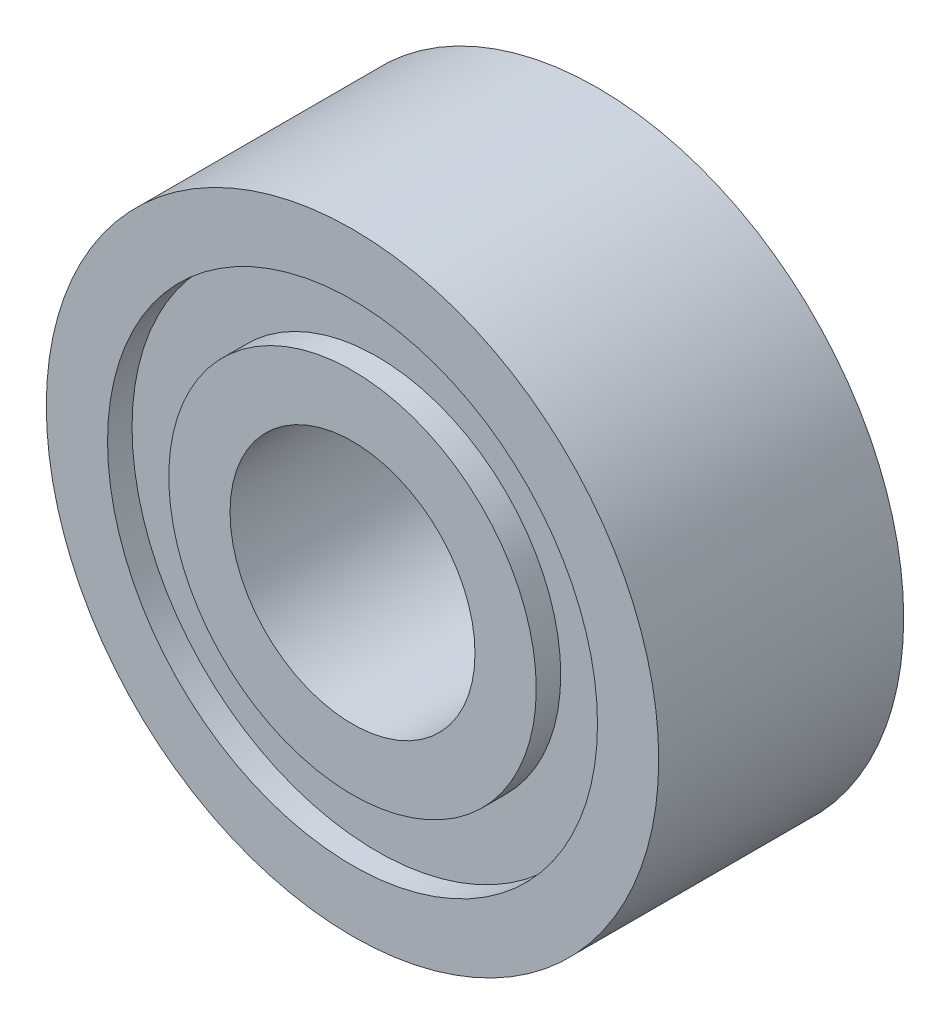
ISO-10303-21;
HEADER;
FILE_DESCRIPTION(('STEP AP214'),'2;1');
FILE_NAME('part.step','',(''),(''),'','','');
FILE_SCHEMA(('AUTOMOTIVE_DESIGN { 1 0 10303 214 1 1 1 1 }'));
ENDSEC;
DATA;
#1=APPLICATION_CONTEXT('core data for automotive mechanical design processes');
#2=APPLICATION_PROTOCOL_DEFINITION('international standard','automotive_design',2000,#1);
#3=PRODUCT_CONTEXT('',#1,'mechanical');
#4=PRODUCT('Part','Part','',(#3));
#5=PRODUCT_RELATED_PRODUCT_CATEGORY('part','',(#4));
#6=PRODUCT_DEFINITION_FORMATION('','',#4);
#7=PRODUCT_DEFINITION_CONTEXT('part definition',#1,'design');
#8=PRODUCT_DEFINITION('design','',#6,#7);
#9=PRODUCT_DEFINITION_SHAPE('','',#8);
#10=(LENGTH_UNIT() NAMED_UNIT(*) SI_UNIT(.MILLI.,.METRE.));
#11=(NAMED_UNIT(*) PLANE_ANGLE_UNIT() SI_UNIT($,.RADIAN.));
#12=(NAMED_UNIT(*) SI_UNIT($,.STERADIAN.) SOLID_ANGLE_UNIT());
#13=UNCERTAINTY_MEASURE_WITH_UNIT(LENGTH_MEASURE(1.E-05),#10,'distance_accuracy_value','');
#14=(GEOMETRIC_REPRESENTATION_CONTEXT(3) GLOBAL_UNCERTAINTY_ASSIGNED_CONTEXT((#13)) GLOBAL_UNIT_ASSIGNED_CONTEXT((#10,
#11,#12)) REPRESENTATION_CONTEXT('',''));
#15=CARTESIAN_POINT('',(0.,0.,0.));
#16=DIRECTION('',(0.,0.,1.));
#17=DIRECTION('',(1.,0.,0.));
#18=AXIS2_PLACEMENT_3D('',#15,#16,#17);
#19=CARTESIAN_POINT('',(-4.1286418728248E-13,1.9999999999995,-1.10919002990261));
#20=DIRECTION('',(0.,0.,-0.999999999999885));
#21=DIRECTION('',(-0.999999999999986,0.,0.));
#22=AXIS2_PLACEMENT_3D('',#19,#20,#21);
#23=PLANE('',#22);
#24=CARTESIAN_POINT('',(0.,0.,-1.10919002990261));
#25=DIRECTION('',(0.,0.,0.999999999999885));
#26=DIRECTION('',(0.999999999999986,0.,0.));
#27=AXIS2_PLACEMENT_3D('',#24,#25,#26);
#28=CIRCLE('',#27,2.);
#29=CARTESIAN_POINT('',(1.99999999999997,0.,-1.10919002990261));
#30=VERTEX_POINT('',#29);
#31=EDGE_CURVE('E86',#30,#30,#28,.T.);
#32=ORIENTED_EDGE('',*,*,#31,.F.);
#33=EDGE_LOOP('',(#32));
#34=FACE_BOUND('',#33,.T.);
#35=CARTESIAN_POINT('',(0.,0.,-1.10919002990261));
#36=DIRECTION('',(0.,0.,0.999999999999885));
#37=DIRECTION('',(0.999999999999986,0.,0.));
#38=AXIS2_PLACEMENT_3D('',#35,#36,#37);
#39=CIRCLE('',#38,2.5);
#40=CARTESIAN_POINT('',(2.49999999999996,0.,-1.10919002990261));
#41=VERTEX_POINT('',#40);
#42=EDGE_CURVE('E10',#41,#41,#39,.T.);
#43=ORIENTED_EDGE('',*,*,#42,.T.);
#44=EDGE_LOOP('',(#43));
#45=FACE_BOUND('',#44,.T.);
#46=ADVANCED_FACE('F35',(#34,#45),#23,.F.);
#47=CARTESIAN_POINT('',(0.,0.,0.));
#48=DIRECTION('',(0.,0.,0.999999999999885));
#49=DIRECTION('',(0.999999999999986,0.,0.));
#50=AXIS2_PLACEMENT_3D('',#47,#48,#49);
#51=CYLINDRICAL_SURFACE('',#50,2.5);
#52=ORIENTED_EDGE('',*,*,#42,.F.);
#53=EDGE_LOOP('',(#52));
#54=FACE_BOUND('',#53,.T.);
#55=CARTESIAN_POINT('',(0.,0.,-3.10919002990261));
#56=DIRECTION('',(0.,0.,0.999999999999885));
#57=DIRECTION('',(0.999999999999986,0.,0.));
#58=AXIS2_PLACEMENT_3D('',#55,#56,#57);
#59=CIRCLE('',#58,2.5);
#60=CARTESIAN_POINT('',(2.49999999999996,0.,-3.10919002990261));
#61=VERTEX_POINT('',#60);
#62=EDGE_CURVE('E42',#61,#61,#59,.T.);
#63=ORIENTED_EDGE('',*,*,#62,.T.);
#64=EDGE_LOOP('',(#63));
#65=FACE_BOUND('',#64,.T.);
#66=ADVANCED_FACE('F94',(#54,#65),#51,.T.);
#67=CARTESIAN_POINT('',(4.82253126321552E-13,2.50000000000002,-3.10919002990261));
#68=DIRECTION('',(0.,0.,0.999999999999885));
#69=DIRECTION('',(0.999999999999986,0.,0.));
#70=AXIS2_PLACEMENT_3D('',#67,#68,#69);
#71=PLANE('',#70);
#72=ORIENTED_EDGE('',*,*,#62,.F.);
#73=EDGE_LOOP('',(#72));
#74=FACE_BOUND('',#73,.T.);
#75=CARTESIAN_POINT('',(0.,0.,-3.10919002990261));
#76=DIRECTION('',(0.,0.,0.999999999999885));
#77=DIRECTION('',(0.999999999999986,0.,0.));
#78=AXIS2_PLACEMENT_3D('',#75,#76,#77);
#79=CIRCLE('',#78,2.);
#80=CARTESIAN_POINT('',(1.99999999999997,0.,-3.10919002990261));
#81=VERTEX_POINT('',#80);
#82=EDGE_CURVE('E47',#81,#81,#79,.T.);
#83=ORIENTED_EDGE('',*,*,#82,.T.);
#84=EDGE_LOOP('',(#83));
#85=FACE_BOUND('',#84,.T.);
#86=ADVANCED_FACE('F98',(#74,#85),#71,.F.);
#87=CARTESIAN_POINT('',(0.,0.,0.));
#88=DIRECTION('',(0.,0.,0.999999999999885));
#89=DIRECTION('',(0.999999999999986,0.,0.));
#90=AXIS2_PLACEMENT_3D('',#87,#88,#89);
#91=CYLINDRICAL_SURFACE('',#90,2.);
#92=ORIENTED_EDGE('',*,*,#82,.F.);
#93=EDGE_LOOP('',(#92));
#94=FACE_BOUND('',#93,.T.);
#95=CARTESIAN_POINT('',(0.,0.,-2.90919002990261));
#96=DIRECTION('',(0.,0.,0.999999999999885));
#97=DIRECTION('',(0.999999999999986,0.,0.));
#98=AXIS2_PLACEMENT_3D('',#95,#96,#97);
#99=CIRCLE('',#98,2.);
#100=CARTESIAN_POINT('',(1.99999999999997,0.,-2.90919002990261));
#101=VERTEX_POINT('',#100);
#102=EDGE_CURVE('E52',#101,#101,#99,.T.);
#103=ORIENTED_EDGE('',*,*,#102,.T.);
#104=EDGE_LOOP('',(#103));
#105=FACE_BOUND('',#104,.T.);
#106=ADVANCED_FACE('F103',(#94,#105),#91,.F.);
#107=CARTESIAN_POINT('',(-1.56125112837913E-13,1.99999999999968,-2.90919002990261));
#108=DIRECTION('',(0.,0.,0.999999999999885));
#109=DIRECTION('',(0.999999999999986,0.,0.));
#110=AXIS2_PLACEMENT_3D('',#107,#108,#109);
#111=PLANE('',#110);
#112=ORIENTED_EDGE('',*,*,#102,.F.);
#113=EDGE_LOOP('',(#112));
#114=FACE_BOUND('',#113,.T.);
#115=CARTESIAN_POINT('',(0.,0.,-2.90919002990261));
#116=DIRECTION('',(0.,0.,0.999999999999885));
#117=DIRECTION('',(0.999999999999986,0.,0.));
#118=AXIS2_PLACEMENT_3D('',#115,#116,#117);
#119=CIRCLE('',#118,1.5);
#120=CARTESIAN_POINT('',(1.49999999999998,0.,-2.90919002990261));
#121=VERTEX_POINT('',#120);
#122=EDGE_CURVE('E58',#121,#121,#119,.T.);
#123=ORIENTED_EDGE('',*,*,#122,.T.);
#124=EDGE_LOOP('',(#123));
#125=FACE_BOUND('',#124,.T.);
#126=ADVANCED_FACE('F109',(#114,#125),#111,.F.);
#127=CARTESIAN_POINT('',(0.,0.,0.));
#128=DIRECTION('',(0.,0.,0.999999999999885));
#129=DIRECTION('',(0.999999999999986,0.,0.));
#130=AXIS2_PLACEMENT_3D('',#127,#128,#129);
#131=CYLINDRICAL_SURFACE('',#130,1.5);
#132=ORIENTED_EDGE('',*,*,#122,.F.);
#133=EDGE_LOOP('',(#132));
#134=FACE_BOUND('',#133,.T.);
#135=CARTESIAN_POINT('',(0.,0.,-3.10919002990261));
#136=DIRECTION('',(0.,0.,0.999999999999885));
#137=DIRECTION('',(0.999999999999986,0.,0.));
#138=AXIS2_PLACEMENT_3D('',#135,#136,#137);
#139=CIRCLE('',#138,1.5);
#140=CARTESIAN_POINT('',(1.49999999999998,0.,-3.10919002990261));
#141=VERTEX_POINT('',#140);
#142=EDGE_CURVE('E62',#141,#141,#139,.T.);
#143=ORIENTED_EDGE('',*,*,#142,.T.);
#144=EDGE_LOOP('',(#143));
#145=FACE_BOUND('',#144,.T.);
#146=ADVANCED_FACE('F113',(#134,#145),#131,.T.);
#147=CARTESIAN_POINT('',(0.,1.50000000000002,-3.10919002990261));
#148=DIRECTION('',(0.,0.,0.999999999999885));
#149=DIRECTION('',(0.999999999999986,0.,0.));
#150=AXIS2_PLACEMENT_3D('',#147,#148,#149);
#151=PLANE('',#150);
#152=ORIENTED_EDGE('',*,*,#142,.F.);
#153=EDGE_LOOP('',(#152));
#154=FACE_BOUND('',#153,.T.);
#155=CARTESIAN_POINT('',(0.,0.,-3.10919002990261));
#156=DIRECTION('',(0.,0.,0.999999999999885));
#157=DIRECTION('',(0.999999999999986,0.,0.));
#158=AXIS2_PLACEMENT_3D('',#155,#156,#157);
#159=CIRCLE('',#158,1.);
#160=CARTESIAN_POINT('',(0.999999999999986,0.,-3.10919002990261));
#161=VERTEX_POINT('',#160);
#162=EDGE_CURVE('E66',#161,#161,#159,.T.);
#163=ORIENTED_EDGE('',*,*,#162,.T.);
#164=EDGE_LOOP('',(#163));
#165=FACE_BOUND('',#164,.T.);
#166=ADVANCED_FACE('F117',(#154,#165),#151,.F.);
#167=CARTESIAN_POINT('',(0.,0.,0.));
#168=DIRECTION('',(0.,0.,0.999999999999885));
#169=DIRECTION('',(0.999999999999986,0.,0.));
#170=AXIS2_PLACEMENT_3D('',#167,#168,#169);
#171=CYLINDRICAL_SURFACE('',#170,1.);
#172=ORIENTED_EDGE('',*,*,#162,.F.);
#173=EDGE_LOOP('',(#172));
#174=FACE_BOUND('',#173,.T.);
#175=CARTESIAN_POINT('',(0.,0.,-1.10919002990261));
#176=DIRECTION('',(0.,0.,0.999999999999885));
#177=DIRECTION('',(0.999999999999986,0.,0.));
#178=AXIS2_PLACEMENT_3D('',#175,#176,#177);
#179=CIRCLE('',#178,1.);
#180=CARTESIAN_POINT('',(0.999999999999986,0.,-1.10919002990261));
#181=VERTEX_POINT('',#180);
#182=EDGE_CURVE('E70',#181,#181,#179,.T.);
#183=ORIENTED_EDGE('',*,*,#182,.T.);
#184=EDGE_LOOP('',(#183));
#185=FACE_BOUND('',#184,.T.);
#186=ADVANCED_FACE('F121',(#174,#185),#171,.F.);
#187=CARTESIAN_POINT('',(7.28583859910259E-13,0.999999999999834,-1.10919002990261));
#188=DIRECTION('',(0.,0.,-0.999999999999885));
#189=DIRECTION('',(-0.999999999999986,0.,0.));
#190=AXIS2_PLACEMENT_3D('',#187,#188,#189);
#191=PLANE('',#190);
#192=ORIENTED_EDGE('',*,*,#182,.F.);
#193=EDGE_LOOP('',(#192));
#194=FACE_BOUND('',#193,.T.);
#195=CARTESIAN_POINT('',(0.,0.,-1.10919002990261));
#196=DIRECTION('',(0.,0.,0.999999999999885));
#197=DIRECTION('',(0.999999999999986,0.,0.));
#198=AXIS2_PLACEMENT_3D('',#195,#196,#197);
#199=CIRCLE('',#198,1.5);
#200=CARTESIAN_POINT('',(1.49999999999998,0.,-1.10919002990261));
#201=VERTEX_POINT('',#200);
#202=EDGE_CURVE('E74',#201,#201,#199,.T.);
#203=ORIENTED_EDGE('',*,*,#202,.T.);
#204=EDGE_LOOP('',(#203));
#205=FACE_BOUND('',#204,.T.);
#206=ADVANCED_FACE('F125',(#194,#205),#191,.F.);
#207=CARTESIAN_POINT('',(0.,0.,0.));
#208=DIRECTION('',(0.,0.,0.999999999999885));
#209=DIRECTION('',(0.999999999999986,0.,0.));
#210=AXIS2_PLACEMENT_3D('',#207,#208,#209);
#211=CYLINDRICAL_SURFACE('',#210,1.5);
#212=ORIENTED_EDGE('',*,*,#202,.F.);
#213=EDGE_LOOP('',(#212));
#214=FACE_BOUND('',#213,.T.);
#215=CARTESIAN_POINT('',(0.,0.,-1.30919002990261));
#216=DIRECTION('',(0.,0.,0.999999999999885));
#217=DIRECTION('',(0.999999999999986,0.,0.));
#218=AXIS2_PLACEMENT_3D('',#215,#216,#217);
#219=CIRCLE('',#218,1.5);
#220=CARTESIAN_POINT('',(1.49999999999998,0.,-1.30919002990261));
#221=VERTEX_POINT('',#220);
#222=EDGE_CURVE('E78',#221,#221,#219,.T.);
#223=ORIENTED_EDGE('',*,*,#222,.T.);
#224=EDGE_LOOP('',(#223));
#225=FACE_BOUND('',#224,.T.);
#226=ADVANCED_FACE('F129',(#214,#225),#211,.T.);
#227=CARTESIAN_POINT('',(0.,1.49999999999977,-1.30919002990261));
#228=DIRECTION('',(0.,0.,-0.999999999999885));
#229=DIRECTION('',(-0.999999999999986,0.,0.));
#230=AXIS2_PLACEMENT_3D('',#227,#228,#229);
#231=PLANE('',#230);
#232=ORIENTED_EDGE('',*,*,#222,.F.);
#233=EDGE_LOOP('',(#232));
#234=FACE_BOUND('',#233,.T.);
#235=CARTESIAN_POINT('',(0.,0.,-1.30919002990261));
#236=DIRECTION('',(0.,0.,0.999999999999885));
#237=DIRECTION('',(0.999999999999986,0.,0.));
#238=AXIS2_PLACEMENT_3D('',#235,#236,#237);
#239=CIRCLE('',#238,2.);
#240=CARTESIAN_POINT('',(1.99999999999997,0.,-1.30919002990261));
#241=VERTEX_POINT('',#240);
#242=EDGE_CURVE('E82',#241,#241,#239,.T.);
#243=ORIENTED_EDGE('',*,*,#242,.T.);
#244=EDGE_LOOP('',(#243));
#245=FACE_BOUND('',#244,.T.);
#246=ADVANCED_FACE('F133',(#234,#245),#231,.F.);
#247=CARTESIAN_POINT('',(0.,0.,0.));
#248=DIRECTION('',(0.,0.,0.999999999999885));
#249=DIRECTION('',(0.999999999999986,0.,0.));
#250=AXIS2_PLACEMENT_3D('',#247,#248,#249);
#251=CYLINDRICAL_SURFACE('',#250,2.);
#252=ORIENTED_EDGE('',*,*,#242,.F.);
#253=EDGE_LOOP('',(#252));
#254=FACE_BOUND('',#253,.T.);
#255=ORIENTED_EDGE('',*,*,#31,.T.);
#256=EDGE_LOOP('',(#255));
#257=FACE_BOUND('',#256,.T.);
#258=ADVANCED_FACE('F91',(#254,#257),#251,.F.);
#259=CLOSED_SHELL('',(#46,#66,#86,#106,#126,#146,#166,#186,#206,#226,#246,#258));
#260=MANIFOLD_SOLID_BREP('B2',#259);
#261=ADVANCED_BREP_SHAPE_REPRESENTATION('',(#18,#260),#14);
#262=SHAPE_DEFINITION_REPRESENTATION(#9,#261);
ENDSEC;
END-ISO-10303-21;
